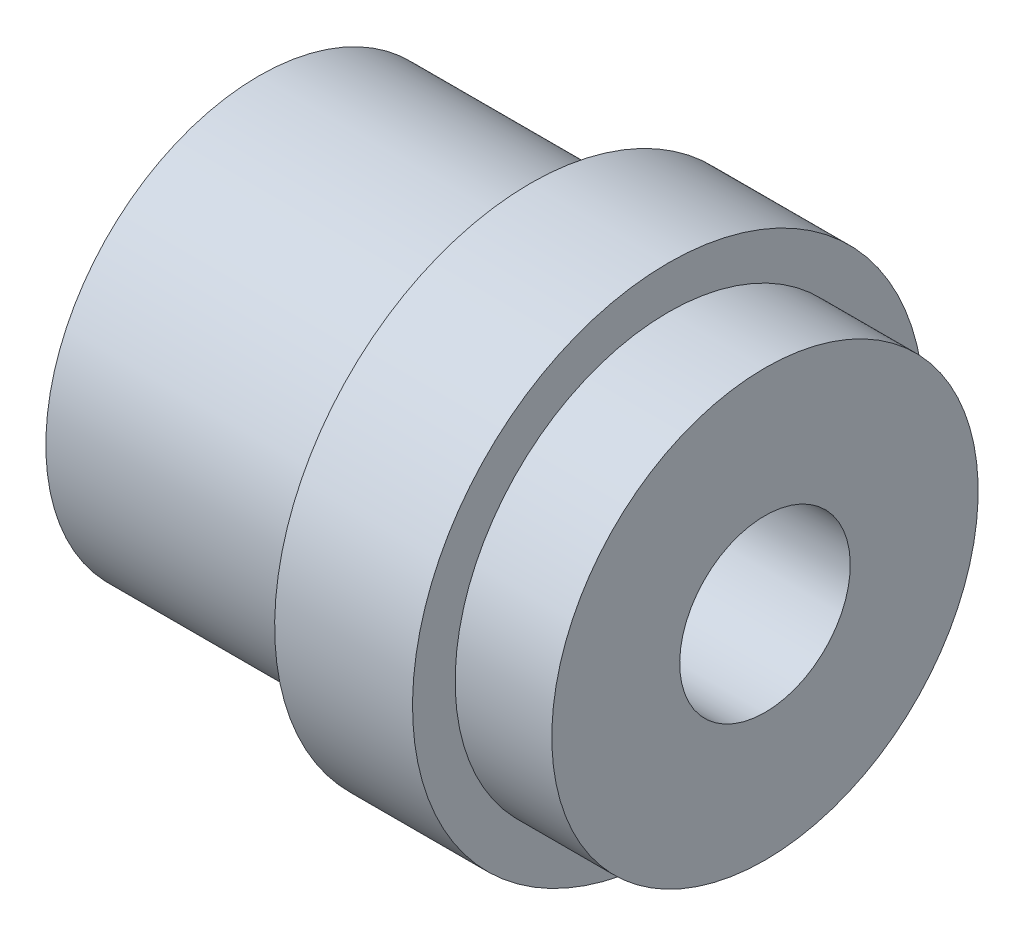
ISO-10303-21;
HEADER;
FILE_DESCRIPTION(('STEP AP214'),'2;1');
FILE_NAME('part.step','',(''),(''),'','','');
FILE_SCHEMA(('AUTOMOTIVE_DESIGN { 1 0 10303 214 1 1 1 1 }'));
ENDSEC;
DATA;
#1=APPLICATION_CONTEXT('core data for automotive mechanical design processes');
#2=APPLICATION_PROTOCOL_DEFINITION('international standard','automotive_design',2000,#1);
#3=PRODUCT_CONTEXT('',#1,'mechanical');
#4=PRODUCT('Part','Part','',(#3));
#5=PRODUCT_RELATED_PRODUCT_CATEGORY('part','',(#4));
#6=PRODUCT_DEFINITION_FORMATION('','',#4);
#7=PRODUCT_DEFINITION_CONTEXT('part definition',#1,'design');
#8=PRODUCT_DEFINITION('design','',#6,#7);
#9=PRODUCT_DEFINITION_SHAPE('','',#8);
#10=(LENGTH_UNIT() NAMED_UNIT(*) SI_UNIT(.MILLI.,.METRE.));
#11=(NAMED_UNIT(*) PLANE_ANGLE_UNIT() SI_UNIT($,.RADIAN.));
#12=(NAMED_UNIT(*) SI_UNIT($,.STERADIAN.) SOLID_ANGLE_UNIT());
#13=UNCERTAINTY_MEASURE_WITH_UNIT(LENGTH_MEASURE(1.E-05),#10,'distance_accuracy_value','');
#14=(GEOMETRIC_REPRESENTATION_CONTEXT(3) GLOBAL_UNCERTAINTY_ASSIGNED_CONTEXT((#13)) GLOBAL_UNIT_ASSIGNED_CONTEXT((#10,
#11,#12)) REPRESENTATION_CONTEXT('',''));
#15=CARTESIAN_POINT('',(0.,0.,0.));
#16=DIRECTION('',(0.,0.,1.));
#17=DIRECTION('',(1.,0.,0.));
#18=AXIS2_PLACEMENT_3D('',#15,#16,#17);
#19=CARTESIAN_POINT('',(-17.8,0.,0.));
#20=DIRECTION('',(-1.,0.,0.));
#21=DIRECTION('',(0.,-1.,0.));
#22=AXIS2_PLACEMENT_3D('',#19,#20,#21);
#23=PLANE('',#22);
#24=CARTESIAN_POINT('',(-17.8,0.,0.));
#25=DIRECTION('',(-1.,0.,0.));
#26=DIRECTION('',(0.,-1.,0.));
#27=AXIS2_PLACEMENT_3D('',#24,#25,#26);
#28=CIRCLE('',#27,3.);
#29=CARTESIAN_POINT('',(-17.8,-3.,0.));
#30=VERTEX_POINT('',#29);
#31=EDGE_CURVE('E57',#30,#30,#28,.T.);
#32=ORIENTED_EDGE('',*,*,#31,.F.);
#33=EDGE_LOOP('',(#32));
#34=FACE_BOUND('',#33,.T.);
#35=CARTESIAN_POINT('',(-17.8,0.,0.));
#36=DIRECTION('',(1.,0.,0.));
#37=DIRECTION('',(0.,1.,0.));
#38=AXIS2_PLACEMENT_3D('',#35,#36,#37);
#39=CIRCLE('',#38,7.5);
#40=CARTESIAN_POINT('',(-17.8,7.5,0.));
#41=VERTEX_POINT('',#40);
#42=EDGE_CURVE('E10',#41,#41,#39,.T.);
#43=ORIENTED_EDGE('',*,*,#42,.F.);
#44=EDGE_LOOP('',(#43));
#45=FACE_BOUND('',#44,.T.);
#46=ADVANCED_FACE('F31',(#34,#45),#23,.T.);
#47=CARTESIAN_POINT('',(0.,0.,0.));
#48=DIRECTION('',(1.,0.,0.));
#49=DIRECTION('',(0.,1.,0.));
#50=AXIS2_PLACEMENT_3D('',#47,#48,#49);
#51=CYLINDRICAL_SURFACE('',#50,7.5);
#52=ORIENTED_EDGE('',*,*,#42,.T.);
#53=EDGE_LOOP('',(#52));
#54=FACE_BOUND('',#53,.T.);
#55=CARTESIAN_POINT('',(-8.24999999999999,0.,0.));
#56=DIRECTION('',(1.,0.,0.));
#57=DIRECTION('',(0.,1.,0.));
#58=AXIS2_PLACEMENT_3D('',#55,#56,#57);
#59=CIRCLE('',#58,7.5);
#60=CARTESIAN_POINT('',(-8.25,7.5,0.));
#61=VERTEX_POINT('',#60);
#62=EDGE_CURVE('E37',#61,#61,#59,.T.);
#63=ORIENTED_EDGE('',*,*,#62,.F.);
#64=EDGE_LOOP('',(#63));
#65=FACE_BOUND('',#64,.T.);
#66=ADVANCED_FACE('F74',(#54,#65),#51,.T.);
#67=CARTESIAN_POINT('',(-8.25,7.5,0.));
#68=DIRECTION('',(-1.,0.,0.));
#69=DIRECTION('',(0.,-1.,0.));
#70=AXIS2_PLACEMENT_3D('',#67,#68,#69);
#71=PLANE('',#70);
#72=ORIENTED_EDGE('',*,*,#62,.T.);
#73=EDGE_LOOP('',(#72));
#74=FACE_BOUND('',#73,.T.);
#75=CARTESIAN_POINT('',(-8.25,0.,0.));
#76=DIRECTION('',(1.,0.,0.));
#77=DIRECTION('',(0.,1.,0.));
#78=AXIS2_PLACEMENT_3D('',#75,#76,#77);
#79=CIRCLE('',#78,9.);
#80=CARTESIAN_POINT('',(-8.25,8.99999999999999,0.));
#81=VERTEX_POINT('',#80);
#82=EDGE_CURVE('E41',#81,#81,#79,.T.);
#83=ORIENTED_EDGE('',*,*,#82,.F.);
#84=EDGE_LOOP('',(#83));
#85=FACE_BOUND('',#84,.T.);
#86=ADVANCED_FACE('F78',(#74,#85),#71,.T.);
#87=CARTESIAN_POINT('',(0.,0.,0.));
#88=DIRECTION('',(1.,0.,0.));
#89=DIRECTION('',(0.,1.,0.));
#90=AXIS2_PLACEMENT_3D('',#87,#88,#89);
#91=CYLINDRICAL_SURFACE('',#90,9.);
#92=ORIENTED_EDGE('',*,*,#82,.T.);
#93=EDGE_LOOP('',(#92));
#94=FACE_BOUND('',#93,.T.);
#95=CARTESIAN_POINT('',(-3.4,0.,0.));
#96=DIRECTION('',(1.,0.,0.));
#97=DIRECTION('',(0.,1.,0.));
#98=AXIS2_PLACEMENT_3D('',#95,#96,#97);
#99=CIRCLE('',#98,9.);
#100=CARTESIAN_POINT('',(-3.4,9.,0.));
#101=VERTEX_POINT('',#100);
#102=EDGE_CURVE('E45',#101,#101,#99,.T.);
#103=ORIENTED_EDGE('',*,*,#102,.F.);
#104=EDGE_LOOP('',(#103));
#105=FACE_BOUND('',#104,.T.);
#106=ADVANCED_FACE('F82',(#94,#105),#91,.T.);
#107=CARTESIAN_POINT('',(-3.4,9.,0.));
#108=DIRECTION('',(1.,0.,0.));
#109=DIRECTION('',(0.,1.,0.));
#110=AXIS2_PLACEMENT_3D('',#107,#108,#109);
#111=PLANE('',#110);
#112=ORIENTED_EDGE('',*,*,#102,.T.);
#113=EDGE_LOOP('',(#112));
#114=FACE_BOUND('',#113,.T.);
#115=CARTESIAN_POINT('',(-3.4,0.,0.));
#116=DIRECTION('',(1.,0.,0.));
#117=DIRECTION('',(0.,1.,0.));
#118=AXIS2_PLACEMENT_3D('',#115,#116,#117);
#119=CIRCLE('',#118,7.5);
#120=CARTESIAN_POINT('',(-3.4,7.5,0.));
#121=VERTEX_POINT('',#120);
#122=EDGE_CURVE('E50',#121,#121,#119,.T.);
#123=ORIENTED_EDGE('',*,*,#122,.F.);
#124=EDGE_LOOP('',(#123));
#125=FACE_BOUND('',#124,.T.);
#126=ADVANCED_FACE('F88',(#114,#125),#111,.T.);
#127=CARTESIAN_POINT('',(0.,0.,0.));
#128=DIRECTION('',(1.,0.,0.));
#129=DIRECTION('',(0.,1.,0.));
#130=AXIS2_PLACEMENT_3D('',#127,#128,#129);
#131=CYLINDRICAL_SURFACE('',#130,7.5);
#132=ORIENTED_EDGE('',*,*,#122,.T.);
#133=EDGE_LOOP('',(#132));
#134=FACE_BOUND('',#133,.T.);
#135=CARTESIAN_POINT('',(0.,0.,0.));
#136=DIRECTION('',(1.,0.,0.));
#137=DIRECTION('',(0.,1.,0.));
#138=AXIS2_PLACEMENT_3D('',#135,#136,#137);
#139=CIRCLE('',#138,7.5);
#140=CARTESIAN_POINT('',(0.,7.5,0.));
#141=VERTEX_POINT('',#140);
#142=EDGE_CURVE('E53',#141,#141,#139,.T.);
#143=ORIENTED_EDGE('',*,*,#142,.F.);
#144=EDGE_LOOP('',(#143));
#145=FACE_BOUND('',#144,.T.);
#146=ADVANCED_FACE('F92',(#134,#145),#131,.T.);
#147=CARTESIAN_POINT('',(0.,7.5,0.));
#148=DIRECTION('',(1.,0.,0.));
#149=DIRECTION('',(0.,1.,0.));
#150=AXIS2_PLACEMENT_3D('',#147,#148,#149);
#151=PLANE('',#150);
#152=CARTESIAN_POINT('',(0.,0.,0.));
#153=DIRECTION('',(-1.,0.,0.));
#154=DIRECTION('',(0.,-1.,0.));
#155=AXIS2_PLACEMENT_3D('',#152,#153,#154);
#156=CIRCLE('',#155,3.);
#157=CARTESIAN_POINT('',(0.,-3.,0.));
#158=VERTEX_POINT('',#157);
#159=EDGE_CURVE('E56',#158,#158,#156,.T.);
#160=ORIENTED_EDGE('',*,*,#159,.T.);
#161=EDGE_LOOP('',(#160));
#162=FACE_BOUND('',#161,.T.);
#163=ORIENTED_EDGE('',*,*,#142,.T.);
#164=EDGE_LOOP('',(#163));
#165=FACE_BOUND('',#164,.T.);
#166=ADVANCED_FACE('F63',(#162,#165),#151,.T.);
#167=CARTESIAN_POINT('',(0.,0.,0.));
#168=DIRECTION('',(-1.,0.,0.));
#169=DIRECTION('',(0.,-1.,0.));
#170=AXIS2_PLACEMENT_3D('',#167,#168,#169);
#171=CYLINDRICAL_SURFACE('',#170,3.);
#172=ORIENTED_EDGE('',*,*,#159,.F.);
#173=EDGE_LOOP('',(#172));
#174=FACE_BOUND('',#173,.T.);
#175=ORIENTED_EDGE('',*,*,#31,.T.);
#176=EDGE_LOOP('',(#175));
#177=FACE_BOUND('',#176,.T.);
#178=ADVANCED_FACE('F66',(#174,#177),#171,.F.);
#179=CLOSED_SHELL('',(#46,#66,#86,#106,#126,#146,#166,#178));
#180=MANIFOLD_SOLID_BREP('B2',#179);
#181=ADVANCED_BREP_SHAPE_REPRESENTATION('',(#18,#180),#14);
#182=SHAPE_DEFINITION_REPRESENTATION(#9,#181);
ENDSEC;
END-ISO-10303-21;
